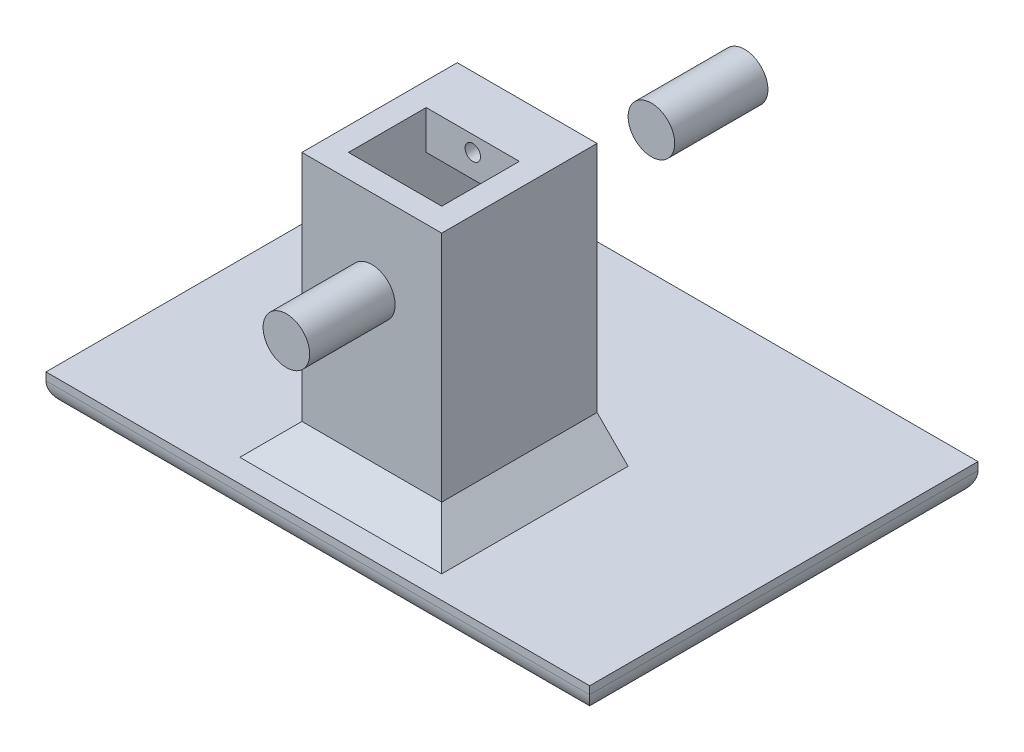
ISO-10303-21;
HEADER;
FILE_DESCRIPTION(('STEP AP214'),'2;1');
FILE_NAME('part.step','',(''),(''),'','','');
FILE_SCHEMA(('AUTOMOTIVE_DESIGN { 1 0 10303 214 1 1 1 1 }'));
ENDSEC;
DATA;
#1=APPLICATION_CONTEXT('core data for automotive mechanical design processes');
#2=APPLICATION_PROTOCOL_DEFINITION('international standard','automotive_design',2000,#1);
#3=PRODUCT_CONTEXT('',#1,'mechanical');
#4=PRODUCT('Part','Part','',(#3));
#5=PRODUCT_RELATED_PRODUCT_CATEGORY('part','',(#4));
#6=PRODUCT_DEFINITION_FORMATION('','',#4);
#7=PRODUCT_DEFINITION_CONTEXT('part definition',#1,'design');
#8=PRODUCT_DEFINITION('design','',#6,#7);
#9=PRODUCT_DEFINITION_SHAPE('','',#8);
#10=(LENGTH_UNIT() NAMED_UNIT(*) SI_UNIT(.MILLI.,.METRE.));
#11=(NAMED_UNIT(*) PLANE_ANGLE_UNIT() SI_UNIT($,.RADIAN.));
#12=(NAMED_UNIT(*) SI_UNIT($,.STERADIAN.) SOLID_ANGLE_UNIT());
#13=UNCERTAINTY_MEASURE_WITH_UNIT(LENGTH_MEASURE(1.E-05),#10,'distance_accuracy_value','');
#14=(GEOMETRIC_REPRESENTATION_CONTEXT(3) GLOBAL_UNCERTAINTY_ASSIGNED_CONTEXT((#13)) GLOBAL_UNIT_ASSIGNED_CONTEXT((#10,
#11,#12)) REPRESENTATION_CONTEXT('',''));
#15=CARTESIAN_POINT('',(0.,0.,0.));
#16=DIRECTION('',(0.,0.,1.));
#17=DIRECTION('',(1.,0.,0.));
#18=AXIS2_PLACEMENT_3D('',#15,#16,#17);
#19=CARTESIAN_POINT('',(0.,-109.542579657602,0.));
#20=DIRECTION('',(0.,-1.,0.));
#21=DIRECTION('',(0.,0.,1.));
#22=AXIS2_PLACEMENT_3D('',#19,#20,#21);
#23=PLANE('',#22);
#24=DIRECTION('',(0.,0.,-1.));
#25=VECTOR('',#24,1.);
#26=CARTESIAN_POINT('',(20.4837754449586,-109.542579657602,0.));
#27=LINE('',#26,#25);
#28=CARTESIAN_POINT('',(20.4837754449586,-109.542579657602,41.3760688395377));
#29=VERTEX_POINT('',#28);
#30=CARTESIAN_POINT('',(20.4837754449586,-109.542579657602,24.3760688395377));
#31=VERTEX_POINT('',#30);
#32=EDGE_CURVE('E507',#29,#31,#27,.T.);
#33=ORIENTED_EDGE('',*,*,#32,.T.);
#34=DIRECTION('',(-1.,0.,0.));
#35=VECTOR('',#34,1.);
#36=CARTESIAN_POINT('',(5.48377535555161,-109.542579657602,24.3760688395377));
#37=LINE('',#36,#35);
#38=CARTESIAN_POINT('',(8.48377544495858,-109.542579657602,24.3760688395377));
#39=VERTEX_POINT('',#38);
#40=EDGE_CURVE('E505',#31,#39,#37,.T.);
#41=ORIENTED_EDGE('',*,*,#40,.T.);
#42=DIRECTION('',(0.,0.,1.));
#43=VECTOR('',#42,1.);
#44=CARTESIAN_POINT('',(8.48377544495858,-109.542579657602,0.));
#45=LINE('',#44,#43);
#46=CARTESIAN_POINT('',(8.48377544495858,-109.542579657602,41.3760688395377));
#47=VERTEX_POINT('',#46);
#48=EDGE_CURVE('E229',#39,#47,#45,.T.);
#49=ORIENTED_EDGE('',*,*,#48,.T.);
#50=DIRECTION('',(1.,0.,0.));
#51=VECTOR('',#50,1.);
#52=CARTESIAN_POINT('',(0.,-109.542579657602,41.3760688395377));
#53=LINE('',#52,#51);
#54=EDGE_CURVE('E512',#47,#29,#53,.T.);
#55=ORIENTED_EDGE('',*,*,#54,.T.);
#56=EDGE_LOOP('',(#33,#41,#49,#55));
#57=FACE_BOUND('',#56,.T.);
#58=DIRECTION('',(-1.,0.,0.));
#59=VECTOR('',#58,1.);
#60=CARTESIAN_POINT('',(12.4837754449586,-109.542579657602,30.3760688395377));
#61=LINE('',#60,#59);
#62=CARTESIAN_POINT('',(16.4837754449586,-109.542579657602,30.3760688395377));
#63=VERTEX_POINT('',#62);
#64=CARTESIAN_POINT('',(12.4837754449586,-109.542579657602,30.3760688395377));
#65=VERTEX_POINT('',#64);
#66=EDGE_CURVE('E264',#63,#65,#61,.T.);
#67=ORIENTED_EDGE('',*,*,#66,.F.);
#68=DIRECTION('',(0.,0.,1.));
#69=VECTOR('',#68,1.);
#70=CARTESIAN_POINT('',(16.4837754449586,-109.542579657602,30.3760688395377));
#71=LINE('',#70,#69);
#72=CARTESIAN_POINT('',(16.4837754449586,-109.542579657602,34.3760688395377));
#73=VERTEX_POINT('',#72);
#74=EDGE_CURVE('E278',#63,#73,#71,.T.);
#75=ORIENTED_EDGE('',*,*,#74,.T.);
#76=DIRECTION('',(-1.,0.,0.));
#77=VECTOR('',#76,1.);
#78=CARTESIAN_POINT('',(12.4837754449586,-109.542579657602,34.3760688395377));
#79=LINE('',#78,#77);
#80=CARTESIAN_POINT('',(12.4837754449586,-109.542579657602,34.3760688395377));
#81=VERTEX_POINT('',#80);
#82=EDGE_CURVE('E259',#73,#81,#79,.T.);
#83=ORIENTED_EDGE('',*,*,#82,.T.);
#84=DIRECTION('',(0.,0.,1.));
#85=VECTOR('',#84,1.);
#86=CARTESIAN_POINT('',(12.4837754449586,-109.542579657602,30.3760688395377));
#87=LINE('',#86,#85);
#88=EDGE_CURVE('E267',#65,#81,#87,.T.);
#89=ORIENTED_EDGE('',*,*,#88,.F.);
#90=EDGE_LOOP('',(#67,#75,#83,#89));
#91=FACE_BOUND('',#90,.T.);
#92=ADVANCED_FACE('F56',(#57,#91),#23,.F.);
#93=CARTESIAN_POINT('',(14.4837754449586,-112.542579896021,34.3760688395377));
#94=DIRECTION('',(0.,0.,-1.));
#95=DIRECTION('',(1.,0.,0.));
#96=AXIS2_PLACEMENT_3D('',#93,#94,#95);
#97=CYLINDRICAL_SURFACE('',#96,1.);
#98=CARTESIAN_POINT('',(14.4837754449586,-112.542579896021,24.3760688395377));
#99=DIRECTION('',(0.,0.,1.));
#100=DIRECTION('',(1.,0.,0.));
#101=AXIS2_PLACEMENT_3D('',#98,#99,#100);
#102=CIRCLE('',#101,1.);
#103=CARTESIAN_POINT('',(15.4837754449586,-112.542579896021,24.3760688395377));
#104=VERTEX_POINT('',#103);
#105=EDGE_CURVE('E286',#104,#104,#102,.T.);
#106=ORIENTED_EDGE('',*,*,#105,.F.);
#107=EDGE_LOOP('',(#106));
#108=FACE_BOUND('',#107,.T.);
#109=CARTESIAN_POINT('',(14.4837754449586,-112.542579896021,30.3760688395377));
#110=DIRECTION('',(0.,0.,-1.));
#111=DIRECTION('',(-1.,0.,0.));
#112=AXIS2_PLACEMENT_3D('',#109,#110,#111);
#113=CIRCLE('',#112,1.);
#114=CARTESIAN_POINT('',(13.4837754449586,-112.542579896021,30.3760688395377));
#115=VERTEX_POINT('',#114);
#116=EDGE_CURVE('E61',#115,#115,#113,.F.);
#117=ORIENTED_EDGE('',*,*,#116,.T.);
#118=EDGE_LOOP('',(#117));
#119=FACE_BOUND('',#118,.T.);
#120=ADVANCED_FACE('F367',(#108,#119),#97,.F.);
#121=CARTESIAN_POINT('',(0.,-116.542579657602,0.));
#122=DIRECTION('',(0.,1.,0.));
#123=DIRECTION('',(0.,0.,-1.));
#124=AXIS2_PLACEMENT_3D('',#121,#122,#123);
#125=PLANE('',#124);
#126=DIRECTION('',(-1.,0.,0.));
#127=VECTOR('',#126,1.);
#128=CARTESIAN_POINT('',(-20.5162245997449,-116.542579657602,1.3256271555211));
#129=LINE('',#128,#127);
#130=CARTESIAN_POINT('',(49.4837754002551,-116.542579657602,1.32562715552109));
#131=VERTEX_POINT('',#130);
#132=CARTESIAN_POINT('',(-20.5162245997449,-116.542579657602,1.3256271555211));
#133=VERTEX_POINT('',#132);
#134=EDGE_CURVE('E488',#131,#133,#129,.T.);
#135=ORIENTED_EDGE('',*,*,#134,.T.);
#136=DIRECTION('',(0.,0.,1.));
#137=VECTOR('',#136,1.);
#138=CARTESIAN_POINT('',(-20.5162245997449,-116.542579657602,51.3256271555211));
#139=LINE('',#138,#137);
#140=CARTESIAN_POINT('',(-20.5162245997449,-116.542579657602,51.3256271555211));
#141=VERTEX_POINT('',#140);
#142=EDGE_CURVE('E491',#133,#141,#139,.T.);
#143=ORIENTED_EDGE('',*,*,#142,.T.);
#144=DIRECTION('',(1.,0.,0.));
#145=VECTOR('',#144,1.);
#146=CARTESIAN_POINT('',(-20.5162245997449,-116.542579657602,51.3256271555211));
#147=LINE('',#146,#145);
#148=CARTESIAN_POINT('',(49.4837754002551,-116.542579657602,51.3256271555211));
#149=VERTEX_POINT('',#148);
#150=EDGE_CURVE('E494',#141,#149,#147,.T.);
#151=ORIENTED_EDGE('',*,*,#150,.T.);
#152=DIRECTION('',(0.,0.,-1.));
#153=VECTOR('',#152,1.);
#154=CARTESIAN_POINT('',(49.4837754002551,-116.542579657602,51.3256271555211));
#155=LINE('',#154,#153);
#156=EDGE_CURVE('E477',#149,#131,#155,.T.);
#157=ORIENTED_EDGE('',*,*,#156,.T.);
#158=EDGE_LOOP('',(#135,#143,#151,#157));
#159=FACE_BOUND('',#158,.T.);
#160=DIRECTION('',(0.,0.,-1.));
#161=VECTOR('',#160,1.);
#162=CARTESIAN_POINT('',(27.4837754449586,-116.542579657602,48.3760688395377));
#163=LINE('',#162,#161);
#164=CARTESIAN_POINT('',(27.4837754449586,-116.542579657602,48.3760688395377));
#165=VERTEX_POINT('',#164);
#166=CARTESIAN_POINT('',(27.4837754449586,-116.542579657602,24.3760688395377));
#167=VERTEX_POINT('',#166);
#168=EDGE_CURVE('E419',#165,#167,#163,.T.);
#169=ORIENTED_EDGE('',*,*,#168,.F.);
#170=DIRECTION('',(1.,0.,0.));
#171=VECTOR('',#170,1.);
#172=CARTESIAN_POINT('',(1.48377535555161,-116.542579657602,48.3760688395377));
#173=LINE('',#172,#171);
#174=CARTESIAN_POINT('',(1.48377535555161,-116.542579657602,48.3760688395377));
#175=VERTEX_POINT('',#174);
#176=EDGE_CURVE('E299',#175,#165,#173,.T.);
#177=ORIENTED_EDGE('',*,*,#176,.F.);
#178=DIRECTION('',(0.,0.,-1.));
#179=VECTOR('',#178,1.);
#180=CARTESIAN_POINT('',(1.48377535555161,-116.542579657602,48.3760688395377));
#181=LINE('',#180,#179);
#182=CARTESIAN_POINT('',(1.48377535555164,-116.542579657602,24.3760688395377));
#183=VERTEX_POINT('',#182);
#184=EDGE_CURVE('E311',#175,#183,#181,.T.);
#185=ORIENTED_EDGE('',*,*,#184,.T.);
#186=DIRECTION('',(-1.,0.,0.));
#187=VECTOR('',#186,1.);
#188=CARTESIAN_POINT('',(49.4837754002551,-116.542579657602,24.3760688395377));
#189=LINE('',#188,#187);
#190=EDGE_CURVE('E289',#167,#183,#189,.T.);
#191=ORIENTED_EDGE('',*,*,#190,.F.);
#192=EDGE_LOOP('',(#169,#177,#185,#191));
#193=FACE_BOUND('',#192,.T.);
#194=ADVANCED_FACE('F363',(#159,#193),#125,.T.);
#195=CARTESIAN_POINT('',(0.,-120.542579657602,0.));
#196=DIRECTION('',(0.,1.,0.));
#197=DIRECTION('',(0.,0.,-1.));
#198=AXIS2_PLACEMENT_3D('',#195,#196,#197);
#199=PLANE('',#198);
#200=DIRECTION('',(0.,0.,1.));
#201=VECTOR('',#200,1.);
#202=CARTESIAN_POINT('',(46.4837754002551,-120.542579657602,1.32462715552108));
#203=LINE('',#202,#201);
#204=CARTESIAN_POINT('',(46.4837754002551,-120.542579657602,4.32562715552109));
#205=VERTEX_POINT('',#204);
#206=CARTESIAN_POINT('',(46.4837754002551,-120.542579657602,48.3256271555211));
#207=VERTEX_POINT('',#206);
#208=EDGE_CURVE('E474',#205,#207,#203,.T.);
#209=ORIENTED_EDGE('',*,*,#208,.T.);
#210=DIRECTION('',(-1.,0.,0.));
#211=VECTOR('',#210,1.);
#212=CARTESIAN_POINT('',(49.4847754002551,-120.542579657602,48.3256271555211));
#213=LINE('',#212,#211);
#214=CARTESIAN_POINT('',(-17.5162245997449,-120.542579657602,48.3256271555211));
#215=VERTEX_POINT('',#214);
#216=EDGE_CURVE('E456',#207,#215,#213,.T.);
#217=ORIENTED_EDGE('',*,*,#216,.T.);
#218=DIRECTION('',(0.,0.,1.));
#219=VECTOR('',#218,1.);
#220=CARTESIAN_POINT('',(-17.5162245997449,-120.542579657602,1.32462715552108));
#221=LINE('',#220,#219);
#222=CARTESIAN_POINT('',(-17.5162245997449,-120.542579657602,4.3256271555211));
#223=VERTEX_POINT('',#222);
#224=EDGE_CURVE('E464',#223,#215,#221,.T.);
#225=ORIENTED_EDGE('',*,*,#224,.F.);
#226=DIRECTION('',(-1.,0.,0.));
#227=VECTOR('',#226,1.);
#228=CARTESIAN_POINT('',(49.4847754002551,-120.542579657602,4.32562715552109));
#229=LINE('',#228,#227);
#230=EDGE_CURVE('E459',#205,#223,#229,.T.);
#231=ORIENTED_EDGE('',*,*,#230,.F.);
#232=EDGE_LOOP('',(#209,#217,#225,#231));
#233=FACE_BOUND('',#232,.T.);
#234=ADVANCED_FACE('F360',(#233),#199,.F.);
#235=CARTESIAN_POINT('',(-20.5162245997449,-120.542579657602,1.3256271555211));
#236=DIRECTION('',(0.,0.,1.));
#237=DIRECTION('',(-1.,0.,0.));
#238=AXIS2_PLACEMENT_3D('',#235,#236,#237);
#239=PLANE('',#238);
#240=DIRECTION('',(1.,0.,0.));
#241=VECTOR('',#240,1.);
#242=CARTESIAN_POINT('',(49.4847754002551,-117.542579657602,1.32562715552109));
#243=LINE('',#242,#241);
#244=CARTESIAN_POINT('',(-20.5162245997449,-117.542579657602,1.3256271555211));
#245=VERTEX_POINT('',#244);
#246=CARTESIAN_POINT('',(49.4837754002551,-117.542579657602,1.32562715552109));
#247=VERTEX_POINT('',#246);
#248=EDGE_CURVE('E455',#245,#247,#243,.T.);
#249=ORIENTED_EDGE('',*,*,#248,.F.);
#250=DIRECTION('',(0.,1.,0.));
#251=VECTOR('',#250,1.);
#252=CARTESIAN_POINT('',(-20.5162245997449,-120.542579657602,1.3256271555211));
#253=LINE('',#252,#251);
#254=EDGE_CURVE('E501',#245,#133,#253,.T.);
#255=ORIENTED_EDGE('',*,*,#254,.T.);
#256=ORIENTED_EDGE('',*,*,#134,.F.);
#257=DIRECTION('',(0.,1.,0.));
#258=VECTOR('',#257,1.);
#259=CARTESIAN_POINT('',(49.4837754002551,-120.542579657602,1.32562715552109));
#260=LINE('',#259,#258);
#261=EDGE_CURVE('E503',#247,#131,#260,.T.);
#262=ORIENTED_EDGE('',*,*,#261,.F.);
#263=EDGE_LOOP('',(#249,#255,#256,#262));
#264=FACE_BOUND('',#263,.T.);
#265=ADVANCED_FACE('F358',(#264),#239,.F.);
#266=CARTESIAN_POINT('',(-17.5162245997449,-117.542579657602,1.32462715552108));
#267=DIRECTION('',(0.,0.,1.));
#268=DIRECTION('',(-1.,0.,0.));
#269=AXIS2_PLACEMENT_3D('',#266,#267,#268);
#270=CYLINDRICAL_SURFACE('',#269,3.);
#271=CARTESIAN_POINT('',(-17.5162245997449,-117.542579657602,4.3256271555211));
#272=DIRECTION('',(0.707106781186547,0.,-0.707106781186548));
#273=DIRECTION('',(-0.707106781186548,0.,-0.707106781186547));
#274=AXIS2_PLACEMENT_3D('',#271,#272,#273);
#275=ELLIPSE('',#274,4.24264068711928,3.);
#276=EDGE_CURVE('E447',#223,#245,#275,.T.);
#277=ORIENTED_EDGE('',*,*,#276,.F.);
#278=ORIENTED_EDGE('',*,*,#224,.T.);
#279=CARTESIAN_POINT('',(-17.5162245997449,-117.542579657602,48.3256271555211));
#280=DIRECTION('',(0.707106781186548,0.,0.707106781186547));
#281=DIRECTION('',(-0.707106781186547,0.,0.707106781186548));
#282=AXIS2_PLACEMENT_3D('',#279,#280,#281);
#283=ELLIPSE('',#282,4.24264068711929,3.);
#284=CARTESIAN_POINT('',(-20.5162245997449,-117.542579657602,51.3256271555211));
#285=VERTEX_POINT('',#284);
#286=EDGE_CURVE('E465',#285,#215,#283,.T.);
#287=ORIENTED_EDGE('',*,*,#286,.F.);
#288=DIRECTION('',(0.,0.,1.));
#289=VECTOR('',#288,1.);
#290=CARTESIAN_POINT('',(-20.5162245997449,-117.542579657602,1.32462715552108));
#291=LINE('',#290,#289);
#292=EDGE_CURVE('E481',#245,#285,#291,.T.);
#293=ORIENTED_EDGE('',*,*,#292,.F.);
#294=EDGE_LOOP('',(#277,#278,#287,#293));
#295=FACE_BOUND('',#294,.T.);
#296=ADVANCED_FACE('F354',(#295),#270,.T.);
#297=CARTESIAN_POINT('',(46.4837754002551,-117.542579657602,1.32462715552108));
#298=DIRECTION('',(0.,0.,1.));
#299=DIRECTION('',(-1.,0.,0.));
#300=AXIS2_PLACEMENT_3D('',#297,#298,#299);
#301=CYLINDRICAL_SURFACE('',#300,3.);
#302=CARTESIAN_POINT('',(46.4837754002551,-117.542579657602,4.32562715552109));
#303=DIRECTION('',(0.707106781186548,0.,0.707106781186547));
#304=DIRECTION('',(-0.707106781186547,0.,0.707106781186548));
#305=AXIS2_PLACEMENT_3D('',#302,#303,#304);
#306=ELLIPSE('',#305,4.24264068711929,3.);
#307=EDGE_CURVE('E462',#247,#205,#306,.F.);
#308=ORIENTED_EDGE('',*,*,#307,.F.);
#309=DIRECTION('',(0.,0.,1.));
#310=VECTOR('',#309,1.);
#311=CARTESIAN_POINT('',(49.4837754002551,-117.542579657602,1.32462715552108));
#312=LINE('',#311,#310);
#313=CARTESIAN_POINT('',(49.4837754002551,-117.542579657602,51.3256271555211));
#314=VERTEX_POINT('',#313);
#315=EDGE_CURVE('E478',#247,#314,#312,.T.);
#316=ORIENTED_EDGE('',*,*,#315,.T.);
#317=CARTESIAN_POINT('',(46.4837754002551,-117.542579657602,48.3256271555211));
#318=DIRECTION('',(0.707106781186547,0.,-0.707106781186548));
#319=DIRECTION('',(-0.707106781186548,0.,-0.707106781186547));
#320=AXIS2_PLACEMENT_3D('',#317,#318,#319);
#321=ELLIPSE('',#320,4.24264068711929,3.);
#322=EDGE_CURVE('E469',#207,#314,#321,.F.);
#323=ORIENTED_EDGE('',*,*,#322,.F.);
#324=ORIENTED_EDGE('',*,*,#208,.F.);
#325=EDGE_LOOP('',(#308,#316,#323,#324));
#326=FACE_BOUND('',#325,.T.);
#327=ADVANCED_FACE('F350',(#326),#301,.T.);
#328=CARTESIAN_POINT('',(49.4837754002551,-120.542579657602,51.3256271555211));
#329=DIRECTION('',(-1.,0.,0.));
#330=DIRECTION('',(0.,-1.,0.));
#331=AXIS2_PLACEMENT_3D('',#328,#329,#330);
#332=PLANE('',#331);
#333=ORIENTED_EDGE('',*,*,#315,.F.);
#334=ORIENTED_EDGE('',*,*,#261,.T.);
#335=ORIENTED_EDGE('',*,*,#156,.F.);
#336=DIRECTION('',(0.,1.,0.));
#337=VECTOR('',#336,1.);
#338=CARTESIAN_POINT('',(49.4837754002551,-120.542579657602,51.3256271555211));
#339=LINE('',#338,#337);
#340=EDGE_CURVE('E497',#314,#149,#339,.T.);
#341=ORIENTED_EDGE('',*,*,#340,.F.);
#342=EDGE_LOOP('',(#333,#334,#335,#341));
#343=FACE_BOUND('',#342,.T.);
#344=ADVANCED_FACE('F353',(#343),#332,.F.);
#345=CARTESIAN_POINT('',(-20.5162245997449,-120.542579657602,51.3256271555211));
#346=DIRECTION('',(1.,0.,0.));
#347=DIRECTION('',(0.,0.,1.));
#348=AXIS2_PLACEMENT_3D('',#345,#346,#347);
#349=PLANE('',#348);
#350=DIRECTION('',(0.,1.,0.));
#351=VECTOR('',#350,1.);
#352=CARTESIAN_POINT('',(-20.5162245997449,-120.542579657602,51.3256271555211));
#353=LINE('',#352,#351);
#354=EDGE_CURVE('E499',#285,#141,#353,.T.);
#355=ORIENTED_EDGE('',*,*,#354,.T.);
#356=ORIENTED_EDGE('',*,*,#142,.F.);
#357=ORIENTED_EDGE('',*,*,#254,.F.);
#358=ORIENTED_EDGE('',*,*,#292,.T.);
#359=EDGE_LOOP('',(#355,#356,#357,#358));
#360=FACE_BOUND('',#359,.T.);
#361=ADVANCED_FACE('F371',(#360),#349,.F.);
#362=CARTESIAN_POINT('',(-20.5162245997449,-120.542579657602,51.3256271555211));
#363=DIRECTION('',(0.,0.,-1.));
#364=DIRECTION('',(0.,-1.,0.));
#365=AXIS2_PLACEMENT_3D('',#362,#363,#364);
#366=PLANE('',#365);
#367=ORIENTED_EDGE('',*,*,#340,.T.);
#368=ORIENTED_EDGE('',*,*,#150,.F.);
#369=ORIENTED_EDGE('',*,*,#354,.F.);
#370=DIRECTION('',(-1.,0.,0.));
#371=VECTOR('',#370,1.);
#372=CARTESIAN_POINT('',(49.4847754002551,-117.542579657602,51.3256271555211));
#373=LINE('',#372,#371);
#374=EDGE_CURVE('E467',#285,#314,#373,.F.);
#375=ORIENTED_EDGE('',*,*,#374,.T.);
#376=EDGE_LOOP('',(#367,#368,#369,#375));
#377=FACE_BOUND('',#376,.T.);
#378=ADVANCED_FACE('F348',(#377),#366,.F.);
#379=CARTESIAN_POINT('',(49.4847754002551,-117.542579657602,48.3256271555211));
#380=DIRECTION('',(-1.,0.,0.));
#381=DIRECTION('',(0.,0.,-1.));
#382=AXIS2_PLACEMENT_3D('',#379,#380,#381);
#383=CYLINDRICAL_SURFACE('',#382,3.);
#384=ORIENTED_EDGE('',*,*,#374,.F.);
#385=ORIENTED_EDGE('',*,*,#286,.T.);
#386=ORIENTED_EDGE('',*,*,#216,.F.);
#387=ORIENTED_EDGE('',*,*,#322,.T.);
#388=EDGE_LOOP('',(#384,#385,#386,#387));
#389=FACE_BOUND('',#388,.T.);
#390=ADVANCED_FACE('F344',(#389),#383,.T.);
#391=CARTESIAN_POINT('',(49.4847754002551,-117.542579657602,4.32562715552109));
#392=DIRECTION('',(-1.,0.,0.));
#393=DIRECTION('',(0.,0.,-1.));
#394=AXIS2_PLACEMENT_3D('',#391,#392,#393);
#395=CYLINDRICAL_SURFACE('',#394,3.);
#396=ORIENTED_EDGE('',*,*,#230,.T.);
#397=ORIENTED_EDGE('',*,*,#276,.T.);
#398=ORIENTED_EDGE('',*,*,#248,.T.);
#399=ORIENTED_EDGE('',*,*,#307,.T.);
#400=EDGE_LOOP('',(#396,#397,#398,#399));
#401=FACE_BOUND('',#400,.T.);
#402=ADVANCED_FACE('F340',(#401),#395,.T.);
#403=CARTESIAN_POINT('',(59.013177506577,-59.013177506577,0.));
#404=DIRECTION('',(0.707106781186548,-0.707106781186547,0.));
#405=DIRECTION('',(0.707106781186547,0.707106781186548,0.));
#406=AXIS2_PLACEMENT_3D('',#403,#404,#405);
#407=PLANE('',#406);
#408=ORIENTED_EDGE('',*,*,#184,.F.);
#409=DIRECTION('',(0.577350269189626,0.577350269189626,-0.577350269189625));
#410=VECTOR('',#409,1.);
#411=CARTESIAN_POINT('',(1.48377535555161,-116.542579657602,48.3760688395377));
#412=LINE('',#411,#410);
#413=CARTESIAN_POINT('',(5.48377535555162,-112.542579657602,44.3760688395377));
#414=VERTEX_POINT('',#413);
#415=EDGE_CURVE('E302',#175,#414,#412,.T.);
#416=ORIENTED_EDGE('',*,*,#415,.T.);
#417=CARTESIAN_POINT('',(5.48377535555162,-112.542579657602,44.3760688395377));
#418=DIRECTION('',(0.,0.,-1.));
#419=VECTOR('',#418,1.);
#420=LINE('',#417,#419);
#421=CARTESIAN_POINT('',(5.48377535555164,-112.542579657602,24.3760688395377));
#422=VERTEX_POINT('',#421);
#423=EDGE_CURVE('E305',#414,#422,#420,.T.);
#424=ORIENTED_EDGE('',*,*,#423,.T.);
#425=DIRECTION('',(0.707106781186547,0.707106781186548,0.));
#426=VECTOR('',#425,1.);
#427=CARTESIAN_POINT('',(59.013177506577,-59.013177506577,24.3760688395377));
#428=LINE('',#427,#426);
#429=EDGE_CURVE('E294',#183,#422,#428,.T.);
#430=ORIENTED_EDGE('',*,*,#429,.F.);
#431=EDGE_LOOP('',(#408,#416,#424,#430));
#432=FACE_BOUND('',#431,.T.);
#433=ADVANCED_FACE('F343',(#432),#407,.F.);
#434=CARTESIAN_POINT('',(-44.5294021063219,-44.5294021063219,0.));
#435=DIRECTION('',(-0.707106781186548,-0.707106781186547,0.));
#436=DIRECTION('',(0.707106781186547,-0.707106781186548,0.));
#437=AXIS2_PLACEMENT_3D('',#434,#435,#436);
#438=PLANE('',#437);
#439=CARTESIAN_POINT('',(23.4837754449586,-112.542579657602,24.3760688395377));
#440=DIRECTION('',(0.,0.,1.));
#441=VECTOR('',#440,1.);
#442=LINE('',#439,#441);
#443=CARTESIAN_POINT('',(23.4837754449586,-112.542579657602,24.3760688395377));
#444=VERTEX_POINT('',#443);
#445=CARTESIAN_POINT('',(23.4837754449586,-112.542579657602,44.3760688395377));
#446=VERTEX_POINT('',#445);
#447=EDGE_CURVE('E408',#444,#446,#442,.T.);
#448=ORIENTED_EDGE('',*,*,#447,.T.);
#449=DIRECTION('',(-0.577350269189626,0.577350269189626,-0.577350269189625));
#450=VECTOR('',#449,1.);
#451=CARTESIAN_POINT('',(27.4837754449586,-116.542579657602,48.3760688395377));
#452=LINE('',#451,#450);
#453=EDGE_CURVE('E306',#165,#446,#452,.T.);
#454=ORIENTED_EDGE('',*,*,#453,.F.);
#455=ORIENTED_EDGE('',*,*,#168,.T.);
#456=DIRECTION('',(0.707106781186547,-0.707106781186548,0.));
#457=VECTOR('',#456,1.);
#458=CARTESIAN_POINT('',(-44.5294021063219,-44.5294021063219,24.3760688395377));
#459=LINE('',#458,#457);
#460=EDGE_CURVE('E292',#444,#167,#459,.T.);
#461=ORIENTED_EDGE('',*,*,#460,.F.);
#462=EDGE_LOOP('',(#448,#454,#455,#461));
#463=FACE_BOUND('',#462,.T.);
#464=ADVANCED_FACE('F337',(#463),#438,.F.);
#465=CARTESIAN_POINT('',(0.,-34.0832554090323,-34.0832554090323));
#466=DIRECTION('',(0.,-0.707106781186547,-0.707106781186548));
#467=DIRECTION('',(0.,-0.707106781186548,0.707106781186547));
#468=AXIS2_PLACEMENT_3D('',#465,#466,#467);
#469=PLANE('',#468);
#470=ORIENTED_EDGE('',*,*,#415,.F.);
#471=ORIENTED_EDGE('',*,*,#176,.T.);
#472=ORIENTED_EDGE('',*,*,#453,.T.);
#473=CARTESIAN_POINT('',(23.4837754449586,-112.542579657602,44.3760688395377));
#474=DIRECTION('',(-1.,0.,0.));
#475=VECTOR('',#474,1.);
#476=LINE('',#473,#475);
#477=EDGE_CURVE('E318',#446,#414,#476,.T.);
#478=ORIENTED_EDGE('',*,*,#477,.T.);
#479=EDGE_LOOP('',(#470,#471,#472,#478));
#480=FACE_BOUND('',#479,.T.);
#481=ADVANCED_FACE('F326',(#480),#469,.F.);
#482=CARTESIAN_POINT('',(0.,-87.5425796576025,41.3760688395377));
#483=DIRECTION('',(0.,0.,1.));
#484=DIRECTION('',(0.,1.,0.));
#485=AXIS2_PLACEMENT_3D('',#482,#483,#484);
#486=PLANE('',#485);
#487=CARTESIAN_POINT('',(14.4837754002551,-93.5425795830966,41.3760688395377));
#488=DIRECTION('',(0.,0.,1.));
#489=DIRECTION('',(1.,0.,0.));
#490=AXIS2_PLACEMENT_3D('',#487,#488,#489);
#491=CIRCLE('',#490,4.);
#492=CARTESIAN_POINT('',(18.4837754002551,-93.5425795830966,41.3760688395377));
#493=VERTEX_POINT('',#492);
#494=EDGE_CURVE('E778',#493,#493,#491,.T.);
#495=ORIENTED_EDGE('',*,*,#494,.T.);
#496=EDGE_LOOP('',(#495));
#497=FACE_BOUND('',#496,.T.);
#498=ORIENTED_EDGE('',*,*,#54,.F.);
#499=DIRECTION('',(0.,-1.,0.));
#500=VECTOR('',#499,1.);
#501=CARTESIAN_POINT('',(8.48377544495858,-87.5425796576025,41.3760688395377));
#502=LINE('',#501,#500);
#503=CARTESIAN_POINT('',(8.48377540025509,-82.5425796576025,41.3760688395377));
#504=VERTEX_POINT('',#503);
#505=EDGE_CURVE('E543',#504,#47,#502,.T.);
#506=ORIENTED_EDGE('',*,*,#505,.F.);
#507=DIRECTION('',(-1.,0.,0.));
#508=VECTOR('',#507,1.);
#509=CARTESIAN_POINT('',(14.4837754002551,-82.5425796576025,41.3760688395377));
#510=LINE('',#509,#508);
#511=CARTESIAN_POINT('',(20.4837754002551,-82.5425796576025,41.3760688395377));
#512=VERTEX_POINT('',#511);
#513=EDGE_CURVE('E785',#512,#504,#510,.T.);
#514=ORIENTED_EDGE('',*,*,#513,.F.);
#515=DIRECTION('',(0.,-1.,0.));
#516=VECTOR('',#515,1.);
#517=CARTESIAN_POINT('',(20.4837754449586,-87.5425796576025,41.3760688395377));
#518=LINE('',#517,#516);
#519=EDGE_CURVE('E541',#512,#29,#518,.T.);
#520=ORIENTED_EDGE('',*,*,#519,.T.);
#521=EDGE_LOOP('',(#498,#506,#514,#520));
#522=FACE_BOUND('',#521,.T.);
#523=ADVANCED_FACE('F336',(#497,#522),#486,.F.);
#524=CARTESIAN_POINT('',(8.48377544495858,-87.5425796576025,0.));
#525=DIRECTION('',(-1.,0.,0.));
#526=DIRECTION('',(0.,0.,-1.));
#527=AXIS2_PLACEMENT_3D('',#524,#525,#526);
#528=PLANE('',#527);
#529=ORIENTED_EDGE('',*,*,#48,.F.);
#530=DIRECTION('',(0.,-1.,0.));
#531=VECTOR('',#530,1.);
#532=CARTESIAN_POINT('',(8.48377544495858,-87.5425796576025,24.3760688395377));
#533=LINE('',#532,#531);
#534=CARTESIAN_POINT('',(8.48377544495858,-87.5425796576025,24.3760688395377));
#535=VERTEX_POINT('',#534);
#536=EDGE_CURVE('E545',#535,#39,#533,.T.);
#537=ORIENTED_EDGE('',*,*,#536,.F.);
#538=DIRECTION('',(0.,0.,1.));
#539=VECTOR('',#538,1.);
#540=CARTESIAN_POINT('',(8.48377544495858,-87.5425796576025,0.));
#541=LINE('',#540,#539);
#542=CARTESIAN_POINT('',(8.4837754002551,-87.5425796576025,31.3760688395377));
#543=VERTEX_POINT('',#542);
#544=EDGE_CURVE('E228',#535,#543,#541,.T.);
#545=ORIENTED_EDGE('',*,*,#544,.T.);
#546=DIRECTION('',(0.,1.,0.));
#547=VECTOR('',#546,1.);
#548=CARTESIAN_POINT('',(8.4837754002551,-120.543579657602,31.3760688395377));
#549=LINE('',#548,#547);
#550=CARTESIAN_POINT('',(8.4837754002551,-82.5425796576025,31.3760688395377));
#551=VERTEX_POINT('',#550);
#552=EDGE_CURVE('E215',#543,#551,#549,.T.);
#553=ORIENTED_EDGE('',*,*,#552,.T.);
#554=DIRECTION('',(0.,0.,-1.));
#555=VECTOR('',#554,1.);
#556=CARTESIAN_POINT('',(8.48377540025509,-82.5425796576025,41.3760688395377));
#557=LINE('',#556,#555);
#558=EDGE_CURVE('E787',#504,#551,#557,.T.);
#559=ORIENTED_EDGE('',*,*,#558,.F.);
#560=ORIENTED_EDGE('',*,*,#505,.T.);
#561=EDGE_LOOP('',(#529,#537,#545,#553,#559,#560));
#562=FACE_BOUND('',#561,.T.);
#563=ADVANCED_FACE('F604',(#562),#528,.F.);
#564=CARTESIAN_POINT('',(20.4837754449586,-87.5425796576025,0.));
#565=DIRECTION('',(1.,0.,0.));
#566=DIRECTION('',(0.,0.,1.));
#567=AXIS2_PLACEMENT_3D('',#564,#565,#566);
#568=PLANE('',#567);
#569=ORIENTED_EDGE('',*,*,#32,.F.);
#570=ORIENTED_EDGE('',*,*,#519,.F.);
#571=DIRECTION('',(0.,0.,1.));
#572=VECTOR('',#571,1.);
#573=CARTESIAN_POINT('',(20.4837754002551,-82.5425796576025,31.3760688395377));
#574=LINE('',#573,#572);
#575=CARTESIAN_POINT('',(20.4837754002551,-82.5425796576025,31.3760688395377));
#576=VERTEX_POINT('',#575);
#577=EDGE_CURVE('E219',#576,#512,#574,.T.);
#578=ORIENTED_EDGE('',*,*,#577,.F.);
#579=DIRECTION('',(0.,1.,0.));
#580=VECTOR('',#579,1.);
#581=CARTESIAN_POINT('',(20.4837754002551,-120.543579657602,31.3760688395377));
#582=LINE('',#581,#580);
#583=CARTESIAN_POINT('',(20.4837754002551,-87.5425796576025,31.3760688395377));
#584=VERTEX_POINT('',#583);
#585=EDGE_CURVE('E212',#584,#576,#582,.T.);
#586=ORIENTED_EDGE('',*,*,#585,.F.);
#587=DIRECTION('',(0.,0.,-1.));
#588=VECTOR('',#587,1.);
#589=CARTESIAN_POINT('',(20.4837754449586,-87.5425796576025,0.));
#590=LINE('',#589,#588);
#591=CARTESIAN_POINT('',(20.4837754449586,-87.5425796576025,24.3760688395377));
#592=VERTEX_POINT('',#591);
#593=EDGE_CURVE('E223',#584,#592,#590,.T.);
#594=ORIENTED_EDGE('',*,*,#593,.T.);
#595=DIRECTION('',(0.,-1.,0.));
#596=VECTOR('',#595,1.);
#597=CARTESIAN_POINT('',(20.4837754449586,-87.5425796576025,24.3760688395377));
#598=LINE('',#597,#596);
#599=EDGE_CURVE('E537',#592,#31,#598,.T.);
#600=ORIENTED_EDGE('',*,*,#599,.T.);
#601=EDGE_LOOP('',(#569,#570,#578,#586,#594,#600));
#602=FACE_BOUND('',#601,.T.);
#603=ADVANCED_FACE('F232',(#602),#568,.F.);
#604=CARTESIAN_POINT('',(0.,-87.5425796576025,24.3760688395377));
#605=DIRECTION('',(0.,0.,1.));
#606=DIRECTION('',(0.,1.,0.));
#607=AXIS2_PLACEMENT_3D('',#604,#605,#606);
#608=PLANE('',#607);
#609=CARTESIAN_POINT('',(14.4837754449586,-84.5425794191839,24.3760688395377));
#610=DIRECTION('',(0.,0.,1.));
#611=DIRECTION('',(1.,0.,0.));
#612=AXIS2_PLACEMENT_3D('',#609,#610,#611);
#613=CIRCLE('',#612,1.00000000000083);
#614=CARTESIAN_POINT('',(15.4837754449594,-84.5425794191839,24.3760688395377));
#615=VERTEX_POINT('',#614);
#616=EDGE_CURVE('E237',#615,#615,#613,.T.);
#617=ORIENTED_EDGE('',*,*,#616,.T.);
#618=EDGE_LOOP('',(#617));
#619=FACE_BOUND('',#618,.T.);
#620=ORIENTED_EDGE('',*,*,#536,.T.);
#621=ORIENTED_EDGE('',*,*,#40,.F.);
#622=ORIENTED_EDGE('',*,*,#599,.F.);
#623=DIRECTION('',(1.,0.,0.));
#624=VECTOR('',#623,1.);
#625=CARTESIAN_POINT('',(5.48377535555162,-87.5425796576025,24.3760688395377));
#626=LINE('',#625,#624);
#627=EDGE_CURVE('E225',#535,#592,#626,.T.);
#628=ORIENTED_EDGE('',*,*,#627,.F.);
#629=EDGE_LOOP('',(#620,#621,#622,#628));
#630=FACE_BOUND('',#629,.T.);
#631=ORIENTED_EDGE('',*,*,#105,.T.);
#632=EDGE_LOOP('',(#631));
#633=FACE_BOUND('',#632,.T.);
#634=DIRECTION('',(0.,-1.,0.));
#635=VECTOR('',#634,1.);
#636=CARTESIAN_POINT('',(5.48377535555161,-87.5425796576025,24.3760688395377));
#637=LINE('',#636,#635);
#638=CARTESIAN_POINT('',(5.48377535555162,-82.5425796576025,24.3760688395377));
#639=VERTEX_POINT('',#638);
#640=EDGE_CURVE('E534',#639,#422,#637,.T.);
#641=ORIENTED_EDGE('',*,*,#640,.F.);
#642=DIRECTION('',(1.,0.,0.));
#643=VECTOR('',#642,1.);
#644=CARTESIAN_POINT('',(5.48377535555162,-82.5425796576025,24.3760688395377));
#645=LINE('',#644,#643);
#646=CARTESIAN_POINT('',(23.4837754449586,-82.5425796576025,24.3760688395377));
#647=VERTEX_POINT('',#646);
#648=EDGE_CURVE('E246',#639,#647,#645,.T.);
#649=ORIENTED_EDGE('',*,*,#648,.T.);
#650=DIRECTION('',(0.,-1.,0.));
#651=VECTOR('',#650,1.);
#652=CARTESIAN_POINT('',(23.4837754449586,-87.5425796576025,24.3760688395377));
#653=LINE('',#652,#651);
#654=EDGE_CURVE('E438',#647,#444,#653,.T.);
#655=ORIENTED_EDGE('',*,*,#654,.T.);
#656=ORIENTED_EDGE('',*,*,#460,.T.);
#657=ORIENTED_EDGE('',*,*,#190,.T.);
#658=ORIENTED_EDGE('',*,*,#429,.T.);
#659=EDGE_LOOP('',(#641,#649,#655,#656,#657,#658));
#660=FACE_BOUND('',#659,.T.);
#661=ADVANCED_FACE('F436',(#619,#630,#633,#660),#608,.F.);
#662=CARTESIAN_POINT('',(5.48377535555161,-87.5425796576025,0.));
#663=DIRECTION('',(-1.,0.,0.));
#664=DIRECTION('',(0.,0.,-1.));
#665=AXIS2_PLACEMENT_3D('',#662,#663,#664);
#666=PLANE('',#665);
#667=DIRECTION('',(0.,-1.,0.));
#668=VECTOR('',#667,1.);
#669=CARTESIAN_POINT('',(5.48377535555162,-87.5425796576025,44.3760688395377));
#670=LINE('',#669,#668);
#671=CARTESIAN_POINT('',(5.48377535555162,-82.5425796576025,44.3760688395377));
#672=VERTEX_POINT('',#671);
#673=EDGE_CURVE('E66',#672,#414,#670,.T.);
#674=ORIENTED_EDGE('',*,*,#673,.F.);
#675=DIRECTION('',(0.,0.,-1.));
#676=VECTOR('',#675,1.);
#677=CARTESIAN_POINT('',(5.48377535555162,-82.5425796576025,44.3760688395377));
#678=LINE('',#677,#676);
#679=EDGE_CURVE('E244',#672,#639,#678,.T.);
#680=ORIENTED_EDGE('',*,*,#679,.T.);
#681=ORIENTED_EDGE('',*,*,#640,.T.);
#682=ORIENTED_EDGE('',*,*,#423,.F.);
#683=EDGE_LOOP('',(#674,#680,#681,#682));
#684=FACE_BOUND('',#683,.T.);
#685=ADVANCED_FACE('F389',(#684),#666,.T.);
#686=CARTESIAN_POINT('',(0.,-87.5425796576025,44.3760688395377));
#687=DIRECTION('',(0.,0.,1.));
#688=DIRECTION('',(0.,1.,0.));
#689=AXIS2_PLACEMENT_3D('',#686,#687,#688);
#690=PLANE('',#689);
#691=CARTESIAN_POINT('',(14.4837754002551,-93.5425795830967,44.3760688395377));
#692=DIRECTION('',(0.,0.,-1.));
#693=DIRECTION('',(0.,1.,0.));
#694=AXIS2_PLACEMENT_3D('',#691,#692,#693);
#695=CIRCLE('',#694,3.);
#696=CARTESIAN_POINT('',(14.4837754002551,-90.5425795830967,44.3760688395377));
#697=VERTEX_POINT('',#696);
#698=EDGE_CURVE('E769',#697,#697,#695,.T.);
#699=ORIENTED_EDGE('',*,*,#698,.T.);
#700=EDGE_LOOP('',(#699));
#701=FACE_BOUND('',#700,.T.);
#702=DIRECTION('',(0.,-1.,0.));
#703=VECTOR('',#702,1.);
#704=CARTESIAN_POINT('',(23.4837754449586,-87.5425796576025,44.3760688395377));
#705=LINE('',#704,#703);
#706=CARTESIAN_POINT('',(23.4837754449586,-82.5425796576025,44.3760688395377));
#707=VERTEX_POINT('',#706);
#708=EDGE_CURVE('E13',#707,#446,#705,.T.);
#709=ORIENTED_EDGE('',*,*,#708,.F.);
#710=DIRECTION('',(-1.,0.,0.));
#711=VECTOR('',#710,1.);
#712=CARTESIAN_POINT('',(5.48377535555162,-82.5425796576025,44.3760688395377));
#713=LINE('',#712,#711);
#714=EDGE_CURVE('E251',#707,#672,#713,.T.);
#715=ORIENTED_EDGE('',*,*,#714,.T.);
#716=ORIENTED_EDGE('',*,*,#673,.T.);
#717=ORIENTED_EDGE('',*,*,#477,.F.);
#718=EDGE_LOOP('',(#709,#715,#716,#717));
#719=FACE_BOUND('',#718,.T.);
#720=ADVANCED_FACE('F385',(#701,#719),#690,.T.);
#721=CARTESIAN_POINT('',(23.4837754449586,-87.5425796576025,0.));
#722=DIRECTION('',(-1.,0.,0.));
#723=DIRECTION('',(0.,0.,-1.));
#724=AXIS2_PLACEMENT_3D('',#721,#722,#723);
#725=PLANE('',#724);
#726=ORIENTED_EDGE('',*,*,#447,.F.);
#727=ORIENTED_EDGE('',*,*,#654,.F.);
#728=DIRECTION('',(0.,0.,1.));
#729=VECTOR('',#728,1.);
#730=CARTESIAN_POINT('',(23.4837754449586,-82.5425796576025,44.3760688395377));
#731=LINE('',#730,#729);
#732=EDGE_CURVE('E249',#647,#707,#731,.T.);
#733=ORIENTED_EDGE('',*,*,#732,.T.);
#734=ORIENTED_EDGE('',*,*,#708,.T.);
#735=EDGE_LOOP('',(#726,#727,#733,#734));
#736=FACE_BOUND('',#735,.T.);
#737=ADVANCED_FACE('F58',(#736),#725,.F.);
#738=CARTESIAN_POINT('',(0.,0.,30.3760688395377));
#739=DIRECTION('',(0.,0.,1.));
#740=DIRECTION('',(-1.,0.,0.));
#741=AXIS2_PLACEMENT_3D('',#738,#739,#740);
#742=PLANE('',#741);
#743=DIRECTION('',(0.,-1.,0.));
#744=VECTOR('',#743,1.);
#745=CARTESIAN_POINT('',(12.4837754449586,-114.542579657602,30.3760688395377));
#746=LINE('',#745,#744);
#747=CARTESIAN_POINT('',(12.4837754449586,-114.542579657602,30.3760688395377));
#748=VERTEX_POINT('',#747);
#749=EDGE_CURVE('E255',#65,#748,#746,.T.);
#750=ORIENTED_EDGE('',*,*,#749,.T.);
#751=DIRECTION('',(1.,0.,0.));
#752=VECTOR('',#751,1.);
#753=CARTESIAN_POINT('',(12.4837754449586,-114.542579657602,30.3760688395377));
#754=LINE('',#753,#752);
#755=CARTESIAN_POINT('',(16.4837754449586,-114.542579657602,30.3760688395377));
#756=VERTEX_POINT('',#755);
#757=EDGE_CURVE('E258',#748,#756,#754,.T.);
#758=ORIENTED_EDGE('',*,*,#757,.T.);
#759=DIRECTION('',(0.,1.,0.));
#760=VECTOR('',#759,1.);
#761=CARTESIAN_POINT('',(16.4837754449586,-114.542579657602,30.3760688395377));
#762=LINE('',#761,#760);
#763=EDGE_CURVE('E262',#756,#63,#762,.T.);
#764=ORIENTED_EDGE('',*,*,#763,.T.);
#765=ORIENTED_EDGE('',*,*,#66,.T.);
#766=EDGE_LOOP('',(#750,#758,#764,#765));
#767=FACE_BOUND('',#766,.T.);
#768=ORIENTED_EDGE('',*,*,#116,.F.);
#769=EDGE_LOOP('',(#768));
#770=FACE_BOUND('',#769,.T.);
#771=ADVANCED_FACE('F558',(#767,#770),#742,.T.);
#772=CARTESIAN_POINT('',(12.4837754449586,-114.542579657602,30.3760688395377));
#773=DIRECTION('',(1.,0.,0.));
#774=DIRECTION('',(0.,0.,1.));
#775=AXIS2_PLACEMENT_3D('',#772,#773,#774);
#776=PLANE('',#775);
#777=DIRECTION('',(0.,-1.,0.));
#778=VECTOR('',#777,1.);
#779=CARTESIAN_POINT('',(12.4837754449586,-114.542579657602,34.3760688395377));
#780=LINE('',#779,#778);
#781=CARTESIAN_POINT('',(12.4837754449586,-114.542579657602,34.3760688395377));
#782=VERTEX_POINT('',#781);
#783=EDGE_CURVE('E253',#81,#782,#780,.T.);
#784=ORIENTED_EDGE('',*,*,#783,.T.);
#785=DIRECTION('',(0.,0.,1.));
#786=VECTOR('',#785,1.);
#787=CARTESIAN_POINT('',(12.4837754449586,-114.542579657602,30.3760688395377));
#788=LINE('',#787,#786);
#789=EDGE_CURVE('E283',#748,#782,#788,.T.);
#790=ORIENTED_EDGE('',*,*,#789,.F.);
#791=ORIENTED_EDGE('',*,*,#749,.F.);
#792=ORIENTED_EDGE('',*,*,#88,.T.);
#793=EDGE_LOOP('',(#784,#790,#791,#792));
#794=FACE_BOUND('',#793,.T.);
#795=ADVANCED_FACE('F562',(#794),#776,.T.);
#796=CARTESIAN_POINT('',(12.4837754449586,-114.542579657602,30.3760688395377));
#797=DIRECTION('',(0.,1.,0.));
#798=DIRECTION('',(-1.,0.,0.));
#799=AXIS2_PLACEMENT_3D('',#796,#797,#798);
#800=PLANE('',#799);
#801=DIRECTION('',(1.,0.,0.));
#802=VECTOR('',#801,1.);
#803=CARTESIAN_POINT('',(12.4837754449586,-114.542579657602,34.3760688395377));
#804=LINE('',#803,#802);
#805=CARTESIAN_POINT('',(16.4837754449586,-114.542579657602,34.3760688395377));
#806=VERTEX_POINT('',#805);
#807=EDGE_CURVE('E270',#782,#806,#804,.T.);
#808=ORIENTED_EDGE('',*,*,#807,.T.);
#809=DIRECTION('',(0.,0.,1.));
#810=VECTOR('',#809,1.);
#811=CARTESIAN_POINT('',(16.4837754449586,-114.542579657602,30.3760688395377));
#812=LINE('',#811,#810);
#813=EDGE_CURVE('E281',#756,#806,#812,.T.);
#814=ORIENTED_EDGE('',*,*,#813,.F.);
#815=ORIENTED_EDGE('',*,*,#757,.F.);
#816=ORIENTED_EDGE('',*,*,#789,.T.);
#817=EDGE_LOOP('',(#808,#814,#815,#816));
#818=FACE_BOUND('',#817,.T.);
#819=ADVANCED_FACE('F568',(#818),#800,.T.);
#820=CARTESIAN_POINT('',(16.4837754449586,-114.542579657602,30.3760688395377));
#821=DIRECTION('',(-1.,0.,0.));
#822=DIRECTION('',(0.,-1.,0.));
#823=AXIS2_PLACEMENT_3D('',#820,#821,#822);
#824=PLANE('',#823);
#825=DIRECTION('',(0.,1.,0.));
#826=VECTOR('',#825,1.);
#827=CARTESIAN_POINT('',(16.4837754449586,-114.542579657602,34.3760688395377));
#828=LINE('',#827,#826);
#829=EDGE_CURVE('E82',#806,#73,#828,.T.);
#830=ORIENTED_EDGE('',*,*,#829,.T.);
#831=ORIENTED_EDGE('',*,*,#74,.F.);
#832=ORIENTED_EDGE('',*,*,#763,.F.);
#833=ORIENTED_EDGE('',*,*,#813,.T.);
#834=EDGE_LOOP('',(#830,#831,#832,#833));
#835=FACE_BOUND('',#834,.T.);
#836=ADVANCED_FACE('F575',(#835),#824,.T.);
#837=CARTESIAN_POINT('',(14.4837754449586,-112.542579896021,34.3760688395377));
#838=DIRECTION('',(0.,0.,-1.));
#839=DIRECTION('',(1.,0.,0.));
#840=AXIS2_PLACEMENT_3D('',#837,#838,#839);
#841=PLANE('',#840);
#842=ORIENTED_EDGE('',*,*,#783,.F.);
#843=ORIENTED_EDGE('',*,*,#82,.F.);
#844=ORIENTED_EDGE('',*,*,#829,.F.);
#845=ORIENTED_EDGE('',*,*,#807,.F.);
#846=EDGE_LOOP('',(#842,#843,#844,#845));
#847=FACE_BOUND('',#846,.T.);
#848=ADVANCED_FACE('F578',(#847),#841,.T.);
#849=CARTESIAN_POINT('',(0.,-87.5425796576025,0.));
#850=DIRECTION('',(0.,1.,0.));
#851=DIRECTION('',(0.,0.,-1.));
#852=AXIS2_PLACEMENT_3D('',#849,#850,#851);
#853=PLANE('',#852);
#854=ORIENTED_EDGE('',*,*,#544,.F.);
#855=ORIENTED_EDGE('',*,*,#627,.T.);
#856=ORIENTED_EDGE('',*,*,#593,.F.);
#857=DIRECTION('',(-1.,0.,0.));
#858=VECTOR('',#857,1.);
#859=CARTESIAN_POINT('',(8.4837754002551,-87.5425796576025,31.3760688395377));
#860=LINE('',#859,#858);
#861=EDGE_CURVE('E207',#584,#543,#860,.T.);
#862=ORIENTED_EDGE('',*,*,#861,.T.);
#863=EDGE_LOOP('',(#854,#855,#856,#862));
#864=FACE_BOUND('',#863,.T.);
#865=ADVANCED_FACE('F224',(#864),#853,.F.);
#866=CARTESIAN_POINT('',(0.,-82.5425796576025,0.));
#867=DIRECTION('',(0.,1.,0.));
#868=DIRECTION('',(0.,0.,-1.));
#869=AXIS2_PLACEMENT_3D('',#866,#867,#868);
#870=PLANE('',#869);
#871=ORIENTED_EDGE('',*,*,#513,.T.);
#872=ORIENTED_EDGE('',*,*,#558,.T.);
#873=DIRECTION('',(1.,0.,0.));
#874=VECTOR('',#873,1.);
#875=CARTESIAN_POINT('',(8.4837754002551,-82.5425796576025,31.3760688395377));
#876=LINE('',#875,#874);
#877=EDGE_CURVE('E74',#551,#576,#876,.T.);
#878=ORIENTED_EDGE('',*,*,#877,.T.);
#879=ORIENTED_EDGE('',*,*,#577,.T.);
#880=EDGE_LOOP('',(#871,#872,#878,#879));
#881=FACE_BOUND('',#880,.T.);
#882=ORIENTED_EDGE('',*,*,#679,.F.);
#883=ORIENTED_EDGE('',*,*,#714,.F.);
#884=ORIENTED_EDGE('',*,*,#732,.F.);
#885=ORIENTED_EDGE('',*,*,#648,.F.);
#886=EDGE_LOOP('',(#882,#883,#884,#885));
#887=FACE_BOUND('',#886,.T.);
#888=ADVANCED_FACE('F554',(#881,#887),#870,.T.);
#889=CARTESIAN_POINT('',(14.4837754449586,-84.5425794191839,34.3760688395377));
#890=DIRECTION('',(0.,0.,-1.));
#891=DIRECTION('',(1.,0.,0.));
#892=AXIS2_PLACEMENT_3D('',#889,#890,#891);
#893=CYLINDRICAL_SURFACE('',#892,1.00000000000083);
#894=CARTESIAN_POINT('',(14.4837754449586,-84.5425794191839,31.3760688395377));
#895=DIRECTION('',(0.,0.,1.));
#896=DIRECTION('',(0.,-1.,0.));
#897=AXIS2_PLACEMENT_3D('',#894,#895,#896);
#898=CIRCLE('',#897,1.00000000000083);
#899=CARTESIAN_POINT('',(14.4837754449586,-85.5425794191847,31.3760688395377));
#900=VERTEX_POINT('',#899);
#901=EDGE_CURVE('E234',#900,#900,#898,.T.);
#902=ORIENTED_EDGE('',*,*,#901,.T.);
#903=EDGE_LOOP('',(#902));
#904=FACE_BOUND('',#903,.T.);
#905=ORIENTED_EDGE('',*,*,#616,.F.);
#906=EDGE_LOOP('',(#905));
#907=FACE_BOUND('',#906,.T.);
#908=ADVANCED_FACE('F685',(#904,#907),#893,.F.);
#909=CARTESIAN_POINT('',(8.4837754002551,-120.543579657602,31.3760688395377));
#910=DIRECTION('',(0.,0.,-1.));
#911=DIRECTION('',(0.,-1.,0.));
#912=AXIS2_PLACEMENT_3D('',#909,#910,#911);
#913=PLANE('',#912);
#914=ORIENTED_EDGE('',*,*,#861,.F.);
#915=ORIENTED_EDGE('',*,*,#585,.T.);
#916=ORIENTED_EDGE('',*,*,#877,.F.);
#917=ORIENTED_EDGE('',*,*,#552,.F.);
#918=EDGE_LOOP('',(#914,#915,#916,#917));
#919=FACE_BOUND('',#918,.T.);
#920=ORIENTED_EDGE('',*,*,#901,.F.);
#921=EDGE_LOOP('',(#920));
#922=FACE_BOUND('',#921,.T.);
#923=ADVANCED_FACE('F209',(#919,#922),#913,.F.);
#924=CARTESIAN_POINT('',(14.4837754002551,-93.5425795830966,43.3760688395377));
#925=DIRECTION('',(0.,0.,-1.));
#926=DIRECTION('',(1.,0.,0.));
#927=AXIS2_PLACEMENT_3D('',#924,#925,#926);
#928=CYLINDRICAL_SURFACE('',#927,4.);
#929=CARTESIAN_POINT('',(14.4837754002551,-93.5425795830966,43.3760688395377));
#930=DIRECTION('',(0.,0.,1.));
#931=DIRECTION('',(1.,0.,0.));
#932=AXIS2_PLACEMENT_3D('',#929,#930,#931);
#933=CIRCLE('',#932,4.);
#934=CARTESIAN_POINT('',(18.4837754002551,-93.5425795830966,43.3760688395377));
#935=VERTEX_POINT('',#934);
#936=EDGE_CURVE('E220',#935,#935,#933,.T.);
#937=ORIENTED_EDGE('',*,*,#936,.T.);
#938=EDGE_LOOP('',(#937));
#939=FACE_BOUND('',#938,.T.);
#940=ORIENTED_EDGE('',*,*,#494,.F.);
#941=EDGE_LOOP('',(#940));
#942=FACE_BOUND('',#941,.T.);
#943=ADVANCED_FACE('F702',(#939,#942),#928,.F.);
#944=CARTESIAN_POINT('',(14.4837754002551,-93.5425795830966,43.3760688395377));
#945=DIRECTION('',(0.,0.,-1.));
#946=DIRECTION('',(1.,0.,0.));
#947=AXIS2_PLACEMENT_3D('',#944,#945,#946);
#948=PLANE('',#947);
#949=CARTESIAN_POINT('',(14.4837754002551,-93.5425795830966,43.3760688395377));
#950=DIRECTION('',(0.,0.,1.));
#951=DIRECTION('',(1.,0.,0.));
#952=AXIS2_PLACEMENT_3D('',#949,#950,#951);
#953=CIRCLE('',#952,2.00000000000001);
#954=CARTESIAN_POINT('',(16.4837754002551,-93.5425795830966,43.3760688395377));
#955=VERTEX_POINT('',#954);
#956=EDGE_CURVE('E772',#955,#955,#953,.T.);
#957=ORIENTED_EDGE('',*,*,#956,.T.);
#958=EDGE_LOOP('',(#957));
#959=FACE_BOUND('',#958,.T.);
#960=ORIENTED_EDGE('',*,*,#936,.F.);
#961=EDGE_LOOP('',(#960));
#962=FACE_BOUND('',#961,.T.);
#963=ADVANCED_FACE('F711',(#959,#962),#948,.T.);
#964=CARTESIAN_POINT('',(14.4837754002551,-93.5425795830966,51.3266271555211));
#965=DIRECTION('',(0.,0.,-1.));
#966=DIRECTION('',(1.,0.,0.));
#967=AXIS2_PLACEMENT_3D('',#964,#965,#966);
#968=CYLINDRICAL_SURFACE('',#967,2.00000000000001);
#969=CARTESIAN_POINT('',(14.4837754002551,-93.5425795830966,44.3760688395377));
#970=DIRECTION('',(0.,0.,-1.));
#971=DIRECTION('',(0.,1.,0.));
#972=AXIS2_PLACEMENT_3D('',#969,#970,#971);
#973=CIRCLE('',#972,2.00000000000001);
#974=CARTESIAN_POINT('',(14.4837754002551,-91.5425795830966,44.3760688395377));
#975=VERTEX_POINT('',#974);
#976=EDGE_CURVE('E768',#975,#975,#973,.F.);
#977=ORIENTED_EDGE('',*,*,#976,.T.);
#978=EDGE_LOOP('',(#977));
#979=FACE_BOUND('',#978,.T.);
#980=ORIENTED_EDGE('',*,*,#956,.F.);
#981=EDGE_LOOP('',(#980));
#982=FACE_BOUND('',#981,.T.);
#983=ADVANCED_FACE('F721',(#979,#982),#968,.F.);
#984=CARTESIAN_POINT('',(14.4837754002551,-93.5425795830967,44.3760688395377));
#985=DIRECTION('',(0.,0.,1.));
#986=DIRECTION('',(0.,1.,0.));
#987=AXIS2_PLACEMENT_3D('',#984,#985,#986);
#988=PLANE('',#987);
#989=ORIENTED_EDGE('',*,*,#976,.F.);
#990=EDGE_LOOP('',(#989));
#991=FACE_BOUND('',#990,.T.);
#992=ADVANCED_FACE('F731',(#991),#988,.F.);
#993=CARTESIAN_POINT('',(14.4837754002551,-93.5425795830967,55.3760688395377));
#994=DIRECTION('',(0.,0.,-1.));
#995=DIRECTION('',(0.,-1.,0.));
#996=AXIS2_PLACEMENT_3D('',#993,#994,#995);
#997=CYLINDRICAL_SURFACE('',#996,3.);
#998=CARTESIAN_POINT('',(14.4837754002551,-93.5425795830967,55.3760688395377));
#999=DIRECTION('',(0.,0.,-1.));
#1000=DIRECTION('',(0.,1.,0.));
#1001=AXIS2_PLACEMENT_3D('',#998,#999,#1000);
#1002=CIRCLE('',#1001,3.);
#1003=CARTESIAN_POINT('',(14.4837754002551,-90.5425795830967,55.3760688395377));
#1004=VERTEX_POINT('',#1003);
#1005=EDGE_CURVE('E767',#1004,#1004,#1002,.T.);
#1006=ORIENTED_EDGE('',*,*,#1005,.T.);
#1007=EDGE_LOOP('',(#1006));
#1008=FACE_BOUND('',#1007,.T.);
#1009=ORIENTED_EDGE('',*,*,#698,.F.);
#1010=EDGE_LOOP('',(#1009));
#1011=FACE_BOUND('',#1010,.T.);
#1012=ADVANCED_FACE('F741',(#1008,#1011),#997,.T.);
#1013=CARTESIAN_POINT('',(14.4837754002551,-93.5425795830967,55.3760688395377));
#1014=DIRECTION('',(0.,0.,1.));
#1015=DIRECTION('',(0.,1.,0.));
#1016=AXIS2_PLACEMENT_3D('',#1013,#1014,#1015);
#1017=PLANE('',#1016);
#1018=ORIENTED_EDGE('',*,*,#1005,.F.);
#1019=EDGE_LOOP('',(#1018));
#1020=FACE_BOUND('',#1019,.T.);
#1021=ADVANCED_FACE('F751',(#1020),#1017,.T.);
#1022=CLOSED_SHELL('',(#92,#120,#194,#234,#265,#296,#327,#344,#361,#378,#390,#402,#433,#464,
#481,#523,#563,#603,#661,#685,#720,#737,#771,#795,#819,#836,#848,#865,#888,#908,#923,#943,#963,
#983,#992,#1012,#1021));
#1023=MANIFOLD_SOLID_BREP('B2',#1022);
#1024=CARTESIAN_POINT('',(14.4837754002551,-93.5425795830966,-3.6239311604623));
#1025=DIRECTION('',(0.,0.,1.));
#1026=DIRECTION('',(-1.,0.,0.));
#1027=AXIS2_PLACEMENT_3D('',#1024,#1025,#1026);
#1028=CYLINDRICAL_SURFACE('',#1027,2.99999995656464);
#1029=CARTESIAN_POINT('',(14.4837754002551,-93.5425795830966,-3.6239311604623));
#1030=DIRECTION('',(0.,0.,1.));
#1031=DIRECTION('',(1.,0.,0.));
#1032=AXIS2_PLACEMENT_3D('',#1029,#1030,#1031);
#1033=CIRCLE('',#1032,2.99999995656464);
#1034=CARTESIAN_POINT('',(17.4837753568197,-93.5425795830966,-3.6239311604623));
#1035=VERTEX_POINT('',#1034);
#1036=EDGE_CURVE('E55',#1035,#1035,#1033,.T.);
#1037=ORIENTED_EDGE('',*,*,#1036,.T.);
#1038=EDGE_LOOP('',(#1037));
#1039=FACE_BOUND('',#1038,.T.);
#1040=CARTESIAN_POINT('',(14.4837754002551,-93.5425795830966,8.3760688395377));
#1041=DIRECTION('',(0.,0.,1.));
#1042=DIRECTION('',(1.,0.,0.));
#1043=AXIS2_PLACEMENT_3D('',#1040,#1041,#1042);
#1044=CIRCLE('',#1043,2.99999995656464);
#1045=CARTESIAN_POINT('',(17.4837753568197,-93.5425795830966,8.3760688395377));
#1046=VERTEX_POINT('',#1045);
#1047=EDGE_CURVE('E985',#1046,#1046,#1044,.T.);
#1048=ORIENTED_EDGE('',*,*,#1047,.F.);
#1049=EDGE_LOOP('',(#1048));
#1050=FACE_BOUND('',#1049,.T.);
#1051=ADVANCED_FACE('F982',(#1039,#1050),#1028,.T.);
#1052=CARTESIAN_POINT('',(14.4837754002551,-93.5425795830966,-3.6239311604623));
#1053=DIRECTION('',(0.,0.,-1.));
#1054=DIRECTION('',(1.,0.,0.));
#1055=AXIS2_PLACEMENT_3D('',#1052,#1053,#1054);
#1056=PLANE('',#1055);
#1057=ORIENTED_EDGE('',*,*,#1036,.F.);
#1058=EDGE_LOOP('',(#1057));
#1059=FACE_BOUND('',#1058,.T.);
#1060=ADVANCED_FACE('F997',(#1059),#1056,.T.);
#1061=CARTESIAN_POINT('',(14.4837754002551,-93.5425795830966,8.3760688395377));
#1062=DIRECTION('',(0.,0.,-1.));
#1063=DIRECTION('',(1.,0.,0.));
#1064=AXIS2_PLACEMENT_3D('',#1061,#1062,#1063);
#1065=PLANE('',#1064);
#1066=ORIENTED_EDGE('',*,*,#1047,.T.);
#1067=EDGE_LOOP('',(#1066));
#1068=FACE_BOUND('',#1067,.T.);
#1069=ADVANCED_FACE('F994',(#1068),#1065,.F.);
#1070=CLOSED_SHELL('',(#1051,#1060,#1069));
#1071=MANIFOLD_SOLID_BREP('B7',#1070);
#1072=ADVANCED_BREP_SHAPE_REPRESENTATION('',(#18,#1023,#1071),#14);
#1073=SHAPE_DEFINITION_REPRESENTATION(#9,#1072);
ENDSEC;
END-ISO-10303-21;
